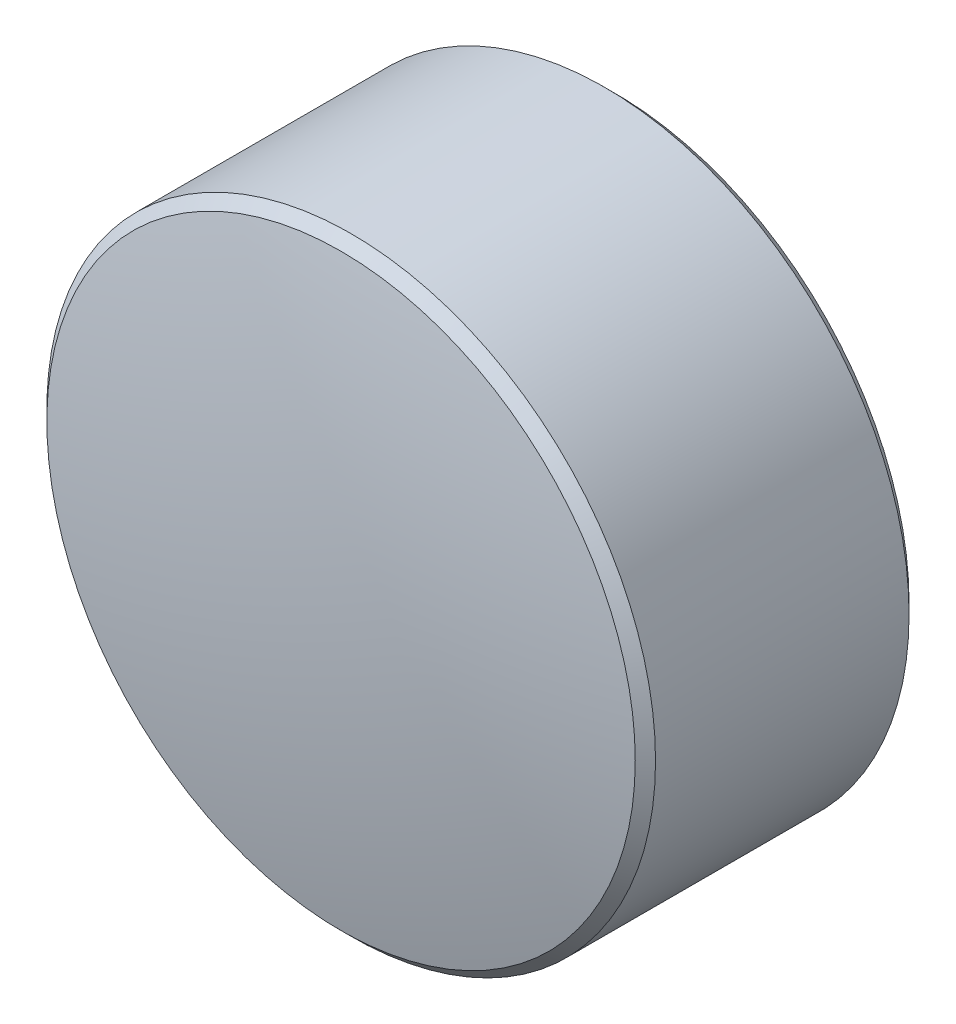
ISO-10303-21;
HEADER;
FILE_DESCRIPTION(('STEP AP214'),'2;1');
FILE_NAME('part.step','',(''),(''),'','','');
FILE_SCHEMA(('AUTOMOTIVE_DESIGN { 1 0 10303 214 1 1 1 1 }'));
ENDSEC;
DATA;
#1=APPLICATION_CONTEXT('core data for automotive mechanical design processes');
#2=APPLICATION_PROTOCOL_DEFINITION('international standard','automotive_design',2000,#1);
#3=PRODUCT_CONTEXT('',#1,'mechanical');
#4=PRODUCT('Part','Part','',(#3));
#5=PRODUCT_RELATED_PRODUCT_CATEGORY('part','',(#4));
#6=PRODUCT_DEFINITION_FORMATION('','',#4);
#7=PRODUCT_DEFINITION_CONTEXT('part definition',#1,'design');
#8=PRODUCT_DEFINITION('design','',#6,#7);
#9=PRODUCT_DEFINITION_SHAPE('','',#8);
#10=(LENGTH_UNIT() NAMED_UNIT(*) SI_UNIT(.MILLI.,.METRE.));
#11=(NAMED_UNIT(*) PLANE_ANGLE_UNIT() SI_UNIT($,.RADIAN.));
#12=(NAMED_UNIT(*) SI_UNIT($,.STERADIAN.) SOLID_ANGLE_UNIT());
#13=UNCERTAINTY_MEASURE_WITH_UNIT(LENGTH_MEASURE(1.E-05),#10,'distance_accuracy_value','');
#14=(GEOMETRIC_REPRESENTATION_CONTEXT(3) GLOBAL_UNCERTAINTY_ASSIGNED_CONTEXT((#13)) GLOBAL_UNIT_ASSIGNED_CONTEXT((#10,
#11,#12)) REPRESENTATION_CONTEXT('',''));
#15=CARTESIAN_POINT('',(0.,0.,0.));
#16=DIRECTION('',(0.,0.,1.));
#17=DIRECTION('',(1.,0.,0.));
#18=AXIS2_PLACEMENT_3D('',#15,#16,#17);
#19=CARTESIAN_POINT('',(1.03368030037882,1.43726924047343,1.68537284083166));
#20=DIRECTION('',(0.,0.,1.));
#21=DIRECTION('',(1.,0.,0.));
#22=AXIS2_PLACEMENT_3D('',#19,#20,#21);
#23=PLANE('',#22);
#24=CARTESIAN_POINT('',(1.03368030037882,1.43726924047343,1.68537284083166));
#25=DIRECTION('',(0.,0.,1.));
#26=DIRECTION('',(1.,0.,0.));
#27=AXIS2_PLACEMENT_3D('',#24,#25,#26);
#28=CIRCLE('',#27,1.45);
#29=CARTESIAN_POINT('',(2.48368030037882,1.43726924047343,1.68537284083166));
#30=VERTEX_POINT('',#29);
#31=EDGE_CURVE('E9',#30,#30,#28,.F.);
#32=ORIENTED_EDGE('',*,*,#31,.T.);
#33=EDGE_LOOP('',(#32));
#34=FACE_BOUND('',#33,.T.);
#35=ADVANCED_FACE('F13',(#34),#23,.F.);
#36=CARTESIAN_POINT('',(1.03368030037882,1.43726924047343,3.18537284083166));
#37=DIRECTION('',(0.,0.,1.));
#38=DIRECTION('',(1.,0.,0.));
#39=AXIS2_PLACEMENT_3D('',#36,#37,#38);
#40=CYLINDRICAL_SURFACE('',#39,1.5);
#41=CARTESIAN_POINT('',(1.03368030037882,1.43726924047343,1.73537284083166));
#42=DIRECTION('',(0.,0.,1.));
#43=DIRECTION('',(1.,0.,0.));
#44=AXIS2_PLACEMENT_3D('',#41,#42,#43);
#45=CIRCLE('',#44,1.5);
#46=CARTESIAN_POINT('',(2.53368030037882,1.43726924047343,1.73537284083166));
#47=VERTEX_POINT('',#46);
#48=EDGE_CURVE('E20',#47,#47,#45,.T.);
#49=ORIENTED_EDGE('',*,*,#48,.T.);
#50=EDGE_LOOP('',(#49));
#51=FACE_BOUND('',#50,.T.);
#52=CARTESIAN_POINT('',(1.03368030037882,1.43726924047343,2.98490986236312));
#53=DIRECTION('',(0.,0.,1.));
#54=DIRECTION('',(1.,0.,0.));
#55=AXIS2_PLACEMENT_3D('',#52,#53,#54);
#56=CIRCLE('',#55,1.5);
#57=CARTESIAN_POINT('',(2.53368030037882,1.43726924047343,2.98490986236312));
#58=VERTEX_POINT('',#57);
#59=EDGE_CURVE('E24',#58,#58,#56,.T.);
#60=ORIENTED_EDGE('',*,*,#59,.F.);
#61=EDGE_LOOP('',(#60));
#62=FACE_BOUND('',#61,.T.);
#63=ADVANCED_FACE('F39',(#51,#62),#40,.T.);
#64=CARTESIAN_POINT('',(1.03368030037882,1.43726924047343,2.98490986236312));
#65=DIRECTION('',(0.,0.,-1.));
#66=DIRECTION('',(-1.,0.,0.));
#67=AXIS2_PLACEMENT_3D('',#64,#65,#66);
#68=CONICAL_SURFACE('',#67,1.5,0.78539816339745);
#69=CARTESIAN_POINT('',(1.03368030037882,1.43726924047343,3.03490986236312));
#70=DIRECTION('',(0.,0.,1.));
#71=DIRECTION('',(1.,0.,0.));
#72=AXIS2_PLACEMENT_3D('',#69,#70,#71);
#73=CIRCLE('',#72,1.45);
#74=CARTESIAN_POINT('',(2.48368030037881,1.43726924047343,3.03490986236312));
#75=VERTEX_POINT('',#74);
#76=EDGE_CURVE('E28',#75,#75,#73,.T.);
#77=ORIENTED_EDGE('',*,*,#76,.F.);
#78=EDGE_LOOP('',(#77));
#79=FACE_BOUND('',#78,.T.);
#80=ORIENTED_EDGE('',*,*,#59,.T.);
#81=EDGE_LOOP('',(#80));
#82=FACE_BOUND('',#81,.T.);
#83=ADVANCED_FACE('F36',(#79,#82),#68,.T.);
#84=CARTESIAN_POINT('',(1.03368030037882,1.43726924047343,-3.87662715916834));
#85=DIRECTION('',(0.,0.,1.));
#86=DIRECTION('',(0.,1.,0.));
#87=AXIS2_PLACEMENT_3D('',#84,#85,#86);
#88=SPHERICAL_SURFACE('',#87,7.062);
#89=ORIENTED_EDGE('',*,*,#76,.T.);
#90=EDGE_LOOP('',(#89));
#91=FACE_BOUND('',#90,.T.);
#92=ADVANCED_FACE('F34',(#91),#88,.T.);
#93=CARTESIAN_POINT('',(1.03368030037882,1.43726924047343,1.73537284083166));
#94=DIRECTION('',(0.,0.,1.));
#95=DIRECTION('',(1.,0.,0.));
#96=AXIS2_PLACEMENT_3D('',#93,#94,#95);
#97=CONICAL_SURFACE('',#96,1.5,0.785398163397438);
#98=ORIENTED_EDGE('',*,*,#31,.F.);
#99=EDGE_LOOP('',(#98));
#100=FACE_BOUND('',#99,.T.);
#101=ORIENTED_EDGE('',*,*,#48,.F.);
#102=EDGE_LOOP('',(#101));
#103=FACE_BOUND('',#102,.T.);
#104=ADVANCED_FACE('F15',(#100,#103),#97,.T.);
#105=CLOSED_SHELL('',(#35,#63,#83,#92,#104));
#106=MANIFOLD_SOLID_BREP('B1',#105);
#107=ADVANCED_BREP_SHAPE_REPRESENTATION('',(#18,#106),#14);
#108=SHAPE_DEFINITION_REPRESENTATION(#9,#107);
ENDSEC;
END-ISO-10303-21;
